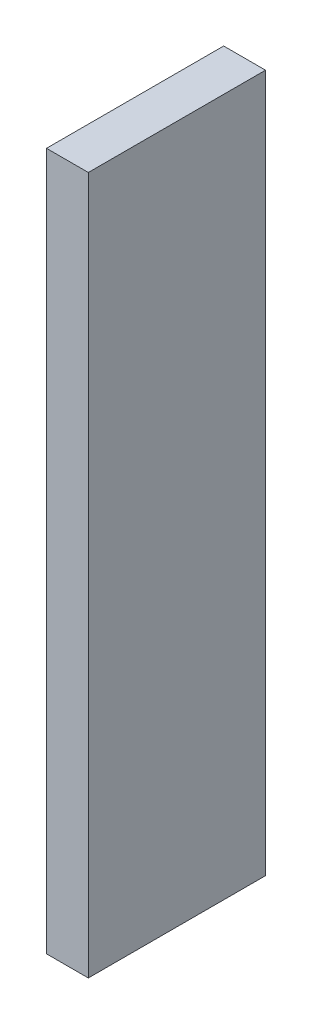
ISO-10303-21;
HEADER;
FILE_DESCRIPTION(('STEP AP214'),'2;1');
FILE_NAME('part.step','',(''),(''),'','','');
FILE_SCHEMA(('AUTOMOTIVE_DESIGN { 1 0 10303 214 1 1 1 1 }'));
ENDSEC;
DATA;
#1=APPLICATION_CONTEXT('core data for automotive mechanical design processes');
#2=APPLICATION_PROTOCOL_DEFINITION('international standard','automotive_design',2000,#1);
#3=PRODUCT_CONTEXT('',#1,'mechanical');
#4=PRODUCT('Part','Part','',(#3));
#5=PRODUCT_RELATED_PRODUCT_CATEGORY('part','',(#4));
#6=PRODUCT_DEFINITION_FORMATION('','',#4);
#7=PRODUCT_DEFINITION_CONTEXT('part definition',#1,'design');
#8=PRODUCT_DEFINITION('design','',#6,#7);
#9=PRODUCT_DEFINITION_SHAPE('','',#8);
#10=(LENGTH_UNIT() NAMED_UNIT(*) SI_UNIT(.MILLI.,.METRE.));
#11=(NAMED_UNIT(*) PLANE_ANGLE_UNIT() SI_UNIT($,.RADIAN.));
#12=(NAMED_UNIT(*) SI_UNIT($,.STERADIAN.) SOLID_ANGLE_UNIT());
#13=UNCERTAINTY_MEASURE_WITH_UNIT(LENGTH_MEASURE(1.E-05),#10,'distance_accuracy_value','');
#14=(GEOMETRIC_REPRESENTATION_CONTEXT(3) GLOBAL_UNCERTAINTY_ASSIGNED_CONTEXT((#13)) GLOBAL_UNIT_ASSIGNED_CONTEXT((#10,
#11,#12)) REPRESENTATION_CONTEXT('',''));
#15=CARTESIAN_POINT('',(0.,0.,0.));
#16=DIRECTION('',(0.,0.,1.));
#17=DIRECTION('',(1.,0.,0.));
#18=AXIS2_PLACEMENT_3D('',#15,#16,#17);
#19=CARTESIAN_POINT('',(-0.75,25.,3.175));
#20=DIRECTION('',(1.,0.,0.));
#21=DIRECTION('',(0.,0.,-1.));
#22=AXIS2_PLACEMENT_3D('',#19,#20,#21);
#23=PLANE('',#22);
#24=DIRECTION('',(0.,0.,1.));
#25=VECTOR('',#24,1.);
#26=CARTESIAN_POINT('',(-0.75,0.,3.175));
#27=LINE('',#26,#25);
#28=CARTESIAN_POINT('',(-0.75,0.,-3.175));
#29=VERTEX_POINT('',#28);
#30=CARTESIAN_POINT('',(-0.75,0.,3.175));
#31=VERTEX_POINT('',#30);
#32=EDGE_CURVE('E96',#29,#31,#27,.T.);
#33=ORIENTED_EDGE('',*,*,#32,.T.);
#34=DIRECTION('',(0.,-1.,0.));
#35=VECTOR('',#34,1.);
#36=CARTESIAN_POINT('',(-0.75,25.,3.175));
#37=LINE('',#36,#35);
#38=CARTESIAN_POINT('',(-0.75,25.,3.175));
#39=VERTEX_POINT('',#38);
#40=EDGE_CURVE('E11',#39,#31,#37,.T.);
#41=ORIENTED_EDGE('',*,*,#40,.F.);
#42=DIRECTION('',(0.,0.,1.));
#43=VECTOR('',#42,1.);
#44=CARTESIAN_POINT('',(-0.75,25.,3.175));
#45=LINE('',#44,#43);
#46=CARTESIAN_POINT('',(-0.75,25.,-3.175));
#47=VERTEX_POINT('',#46);
#48=EDGE_CURVE('E84',#47,#39,#45,.T.);
#49=ORIENTED_EDGE('',*,*,#48,.F.);
#50=DIRECTION('',(0.,-1.,0.));
#51=VECTOR('',#50,1.);
#52=CARTESIAN_POINT('',(-0.75,25.,-3.175));
#53=LINE('',#52,#51);
#54=EDGE_CURVE('E92',#47,#29,#53,.T.);
#55=ORIENTED_EDGE('',*,*,#54,.T.);
#56=EDGE_LOOP('',(#33,#41,#49,#55));
#57=FACE_BOUND('',#56,.T.);
#58=ADVANCED_FACE('F33',(#57),#23,.F.);
#59=CARTESIAN_POINT('',(0.75,25.,3.175));
#60=DIRECTION('',(0.,0.,-1.));
#61=DIRECTION('',(-1.,0.,0.));
#62=AXIS2_PLACEMENT_3D('',#59,#60,#61);
#63=PLANE('',#62);
#64=DIRECTION('',(1.,0.,0.));
#65=VECTOR('',#64,1.);
#66=CARTESIAN_POINT('',(0.75,0.,3.175));
#67=LINE('',#66,#65);
#68=CARTESIAN_POINT('',(0.75,0.,3.175));
#69=VERTEX_POINT('',#68);
#70=EDGE_CURVE('E88',#31,#69,#67,.T.);
#71=ORIENTED_EDGE('',*,*,#70,.T.);
#72=DIRECTION('',(0.,-1.,0.));
#73=VECTOR('',#72,1.);
#74=CARTESIAN_POINT('',(0.75,25.,3.175));
#75=LINE('',#74,#73);
#76=CARTESIAN_POINT('',(0.75,25.,3.175));
#77=VERTEX_POINT('',#76);
#78=EDGE_CURVE('E41',#77,#69,#75,.T.);
#79=ORIENTED_EDGE('',*,*,#78,.F.);
#80=DIRECTION('',(1.,0.,0.));
#81=VECTOR('',#80,1.);
#82=CARTESIAN_POINT('',(0.75,25.,3.175));
#83=LINE('',#82,#81);
#84=EDGE_CURVE('E79',#39,#77,#83,.T.);
#85=ORIENTED_EDGE('',*,*,#84,.F.);
#86=ORIENTED_EDGE('',*,*,#40,.T.);
#87=EDGE_LOOP('',(#71,#79,#85,#86));
#88=FACE_BOUND('',#87,.T.);
#89=ADVANCED_FACE('F87',(#88),#63,.F.);
#90=CARTESIAN_POINT('',(0.75,25.,3.175));
#91=DIRECTION('',(-1.,0.,0.));
#92=DIRECTION('',(0.,0.,1.));
#93=AXIS2_PLACEMENT_3D('',#90,#91,#92);
#94=PLANE('',#93);
#95=DIRECTION('',(0.,0.,-1.));
#96=VECTOR('',#95,1.);
#97=CARTESIAN_POINT('',(0.75,0.,3.175));
#98=LINE('',#97,#96);
#99=CARTESIAN_POINT('',(0.75,0.,-3.175));
#100=VERTEX_POINT('',#99);
#101=EDGE_CURVE('E66',#69,#100,#98,.T.);
#102=ORIENTED_EDGE('',*,*,#101,.T.);
#103=DIRECTION('',(0.,-1.,0.));
#104=VECTOR('',#103,1.);
#105=CARTESIAN_POINT('',(0.75,25.,-3.175));
#106=LINE('',#105,#104);
#107=CARTESIAN_POINT('',(0.75,25.,-3.175));
#108=VERTEX_POINT('',#107);
#109=EDGE_CURVE('E89',#108,#100,#106,.T.);
#110=ORIENTED_EDGE('',*,*,#109,.F.);
#111=DIRECTION('',(0.,0.,-1.));
#112=VECTOR('',#111,1.);
#113=CARTESIAN_POINT('',(0.75,25.,3.175));
#114=LINE('',#113,#112);
#115=EDGE_CURVE('E82',#77,#108,#114,.T.);
#116=ORIENTED_EDGE('',*,*,#115,.F.);
#117=ORIENTED_EDGE('',*,*,#78,.T.);
#118=EDGE_LOOP('',(#102,#110,#116,#117));
#119=FACE_BOUND('',#118,.T.);
#120=ADVANCED_FACE('F90',(#119),#94,.F.);
#121=CARTESIAN_POINT('',(0.75,25.,-3.175));
#122=DIRECTION('',(0.,0.,1.));
#123=DIRECTION('',(1.,0.,0.));
#124=AXIS2_PLACEMENT_3D('',#121,#122,#123);
#125=PLANE('',#124);
#126=DIRECTION('',(-1.,0.,0.));
#127=VECTOR('',#126,1.);
#128=CARTESIAN_POINT('',(0.75,0.,-3.175));
#129=LINE('',#128,#127);
#130=EDGE_CURVE('E72',#100,#29,#129,.T.);
#131=ORIENTED_EDGE('',*,*,#130,.T.);
#132=ORIENTED_EDGE('',*,*,#54,.F.);
#133=DIRECTION('',(-1.,0.,0.));
#134=VECTOR('',#133,1.);
#135=CARTESIAN_POINT('',(0.75,25.,-3.175));
#136=LINE('',#135,#134);
#137=EDGE_CURVE('E49',#108,#47,#136,.T.);
#138=ORIENTED_EDGE('',*,*,#137,.F.);
#139=ORIENTED_EDGE('',*,*,#109,.T.);
#140=EDGE_LOOP('',(#131,#132,#138,#139));
#141=FACE_BOUND('',#140,.T.);
#142=ADVANCED_FACE('F103',(#141),#125,.F.);
#143=CARTESIAN_POINT('',(0.,25.,0.));
#144=DIRECTION('',(0.,1.,0.));
#145=DIRECTION('',(0.,0.,1.));
#146=AXIS2_PLACEMENT_3D('',#143,#144,#145);
#147=PLANE('',#146);
#148=ORIENTED_EDGE('',*,*,#48,.T.);
#149=ORIENTED_EDGE('',*,*,#84,.T.);
#150=ORIENTED_EDGE('',*,*,#115,.T.);
#151=ORIENTED_EDGE('',*,*,#137,.T.);
#152=EDGE_LOOP('',(#148,#149,#150,#151));
#153=FACE_BOUND('',#152,.T.);
#154=ADVANCED_FACE('F80',(#153),#147,.T.);
#155=CARTESIAN_POINT('',(0.,0.,0.));
#156=DIRECTION('',(0.,1.,0.));
#157=DIRECTION('',(0.,0.,1.));
#158=AXIS2_PLACEMENT_3D('',#155,#156,#157);
#159=PLANE('',#158);
#160=ORIENTED_EDGE('',*,*,#32,.F.);
#161=ORIENTED_EDGE('',*,*,#130,.F.);
#162=ORIENTED_EDGE('',*,*,#101,.F.);
#163=ORIENTED_EDGE('',*,*,#70,.F.);
#164=EDGE_LOOP('',(#160,#161,#162,#163));
#165=FACE_BOUND('',#164,.T.);
#166=ADVANCED_FACE('F106',(#165),#159,.F.);
#167=CLOSED_SHELL('',(#58,#89,#120,#142,#154,#166));
#168=MANIFOLD_SOLID_BREP('B2',#167);
#169=ADVANCED_BREP_SHAPE_REPRESENTATION('',(#18,#168),#14);
#170=SHAPE_DEFINITION_REPRESENTATION(#9,#169);
ENDSEC;
END-ISO-10303-21;
